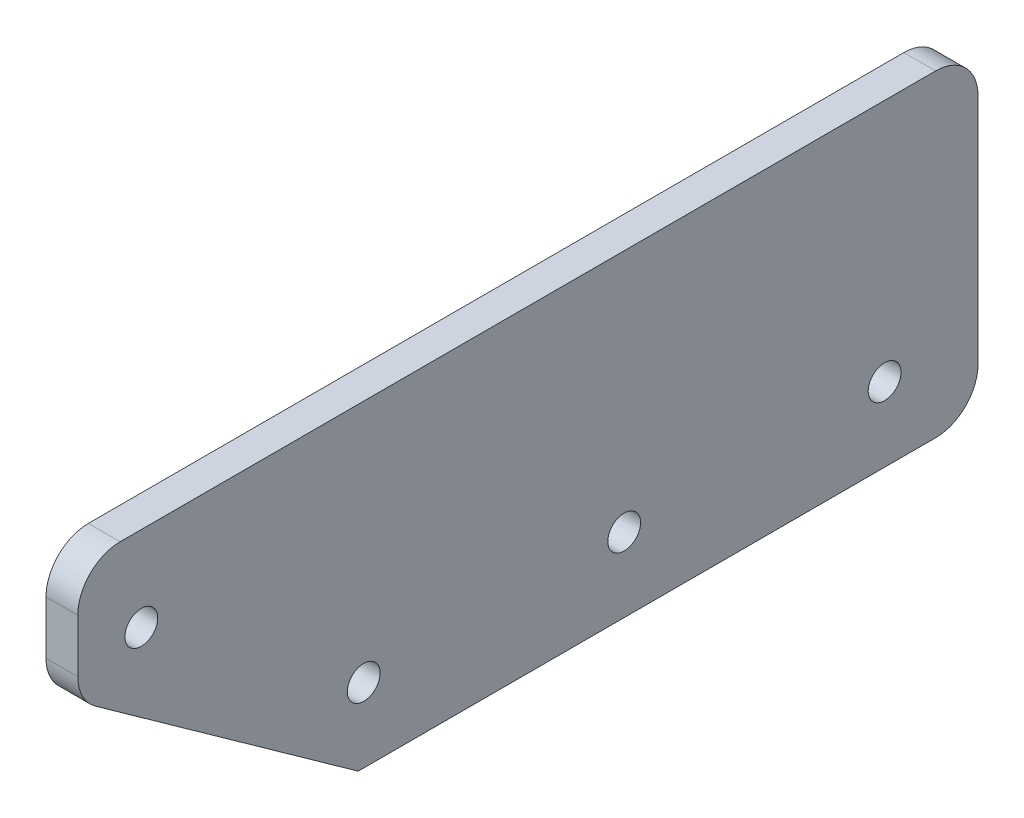
ISO-10303-21;
HEADER;
FILE_DESCRIPTION(('STEP AP214'),'2;1');
FILE_NAME('part.step','',(''),(''),'','','');
FILE_SCHEMA(('AUTOMOTIVE_DESIGN { 1 0 10303 214 1 1 1 1 }'));
ENDSEC;
DATA;
#1=APPLICATION_CONTEXT('core data for automotive mechanical design processes');
#2=APPLICATION_PROTOCOL_DEFINITION('international standard','automotive_design',2000,#1);
#3=PRODUCT_CONTEXT('',#1,'mechanical');
#4=PRODUCT('Part','Part','',(#3));
#5=PRODUCT_RELATED_PRODUCT_CATEGORY('part','',(#4));
#6=PRODUCT_DEFINITION_FORMATION('','',#4);
#7=PRODUCT_DEFINITION_CONTEXT('part definition',#1,'design');
#8=PRODUCT_DEFINITION('design','',#6,#7);
#9=PRODUCT_DEFINITION_SHAPE('','',#8);
#10=(LENGTH_UNIT() NAMED_UNIT(*) SI_UNIT(.MILLI.,.METRE.));
#11=(NAMED_UNIT(*) PLANE_ANGLE_UNIT() SI_UNIT($,.RADIAN.));
#12=(NAMED_UNIT(*) SI_UNIT($,.STERADIAN.) SOLID_ANGLE_UNIT());
#13=UNCERTAINTY_MEASURE_WITH_UNIT(LENGTH_MEASURE(1.E-05),#10,'distance_accuracy_value','');
#14=(GEOMETRIC_REPRESENTATION_CONTEXT(3) GLOBAL_UNCERTAINTY_ASSIGNED_CONTEXT((#13)) GLOBAL_UNIT_ASSIGNED_CONTEXT((#10,
#11,#12)) REPRESENTATION_CONTEXT('',''));
#15=CARTESIAN_POINT('',(0.,0.,0.));
#16=DIRECTION('',(0.,0.,1.));
#17=DIRECTION('',(1.,0.,0.));
#18=AXIS2_PLACEMENT_3D('',#15,#16,#17);
#19=CARTESIAN_POINT('',(3.,0.,0.));
#20=DIRECTION('',(0.,0.,-1.));
#21=DIRECTION('',(-1.,0.,0.));
#22=AXIS2_PLACEMENT_3D('',#19,#20,#21);
#23=PLANE('',#22);
#24=DIRECTION('',(0.,-1.,0.));
#25=VECTOR('',#24,1.);
#26=CARTESIAN_POINT('',(0.,0.,0.));
#27=LINE('',#26,#25);
#28=CARTESIAN_POINT('',(0.,26.,0.));
#29=VERTEX_POINT('',#28);
#30=CARTESIAN_POINT('',(0.,20.9707642094164,0.));
#31=VERTEX_POINT('',#30);
#32=EDGE_CURVE('E127',#29,#31,#27,.T.);
#33=ORIENTED_EDGE('',*,*,#32,.T.);
#34=DIRECTION('',(1.,0.,0.));
#35=VECTOR('',#34,1.);
#36=CARTESIAN_POINT('',(3.,20.9707642094164,0.));
#37=LINE('',#36,#35);
#38=CARTESIAN_POINT('',(3.,20.9707642094164,0.));
#39=VERTEX_POINT('',#38);
#40=EDGE_CURVE('E142',#31,#39,#37,.T.);
#41=ORIENTED_EDGE('',*,*,#40,.T.);
#42=DIRECTION('',(0.,-1.,0.));
#43=VECTOR('',#42,1.);
#44=CARTESIAN_POINT('',(3.,0.,0.));
#45=LINE('',#44,#43);
#46=CARTESIAN_POINT('',(3.,26.,0.));
#47=VERTEX_POINT('',#46);
#48=EDGE_CURVE('E138',#47,#39,#45,.T.);
#49=ORIENTED_EDGE('',*,*,#48,.F.);
#50=DIRECTION('',(-1.,0.,0.));
#51=VECTOR('',#50,1.);
#52=CARTESIAN_POINT('',(3.,26.,0.));
#53=LINE('',#52,#51);
#54=EDGE_CURVE('E139',#47,#29,#53,.T.);
#55=ORIENTED_EDGE('',*,*,#54,.T.);
#56=EDGE_LOOP('',(#33,#41,#49,#55));
#57=FACE_BOUND('',#56,.T.);
#58=ADVANCED_FACE('F35',(#57),#23,.F.);
#59=CARTESIAN_POINT('',(3.,0.,0.));
#60=DIRECTION('',(0.,1.,0.));
#61=DIRECTION('',(0.,0.,1.));
#62=AXIS2_PLACEMENT_3D('',#59,#60,#61);
#63=PLANE('',#62);
#64=DIRECTION('',(0.,0.,-1.));
#65=VECTOR('',#64,1.);
#66=CARTESIAN_POINT('',(0.,0.,0.));
#67=LINE('',#66,#65);
#68=CARTESIAN_POINT('',(0.,0.,-26.4772096795489));
#69=VERTEX_POINT('',#68);
#70=CARTESIAN_POINT('',(0.,0.,-81.));
#71=VERTEX_POINT('',#70);
#72=EDGE_CURVE('E118',#69,#71,#67,.T.);
#73=ORIENTED_EDGE('',*,*,#72,.T.);
#74=DIRECTION('',(-1.,0.,0.));
#75=VECTOR('',#74,1.);
#76=CARTESIAN_POINT('',(3.,0.,-81.));
#77=LINE('',#76,#75);
#78=CARTESIAN_POINT('',(3.,0.,-81.));
#79=VERTEX_POINT('',#78);
#80=EDGE_CURVE('E166',#71,#79,#77,.F.);
#81=ORIENTED_EDGE('',*,*,#80,.T.);
#82=DIRECTION('',(0.,0.,-1.));
#83=VECTOR('',#82,1.);
#84=CARTESIAN_POINT('',(3.,0.,0.));
#85=LINE('',#84,#83);
#86=CARTESIAN_POINT('',(3.,0.,-26.4772096795489));
#87=VERTEX_POINT('',#86);
#88=EDGE_CURVE('E121',#87,#79,#85,.T.);
#89=ORIENTED_EDGE('',*,*,#88,.F.);
#90=DIRECTION('',(1.,0.,0.));
#91=VECTOR('',#90,1.);
#92=CARTESIAN_POINT('',(0.,0.,-26.4772096795489));
#93=LINE('',#92,#91);
#94=EDGE_CURVE('E108',#69,#87,#93,.T.);
#95=ORIENTED_EDGE('',*,*,#94,.F.);
#96=EDGE_LOOP('',(#73,#81,#89,#95));
#97=FACE_BOUND('',#96,.T.);
#98=ADVANCED_FACE('F117',(#97),#63,.F.);
#99=CARTESIAN_POINT('',(3.,0.,-85.));
#100=DIRECTION('',(0.,0.,1.));
#101=DIRECTION('',(1.,0.,0.));
#102=AXIS2_PLACEMENT_3D('',#99,#100,#101);
#103=PLANE('',#102);
#104=DIRECTION('',(0.,1.,0.));
#105=VECTOR('',#104,1.);
#106=CARTESIAN_POINT('',(3.,0.,-85.));
#107=LINE('',#106,#105);
#108=CARTESIAN_POINT('',(3.,4.,-85.));
#109=VERTEX_POINT('',#108);
#110=CARTESIAN_POINT('',(3.,26.,-85.));
#111=VERTEX_POINT('',#110);
#112=EDGE_CURVE('E187',#109,#111,#107,.T.);
#113=ORIENTED_EDGE('',*,*,#112,.F.);
#114=DIRECTION('',(-1.,0.,0.));
#115=VECTOR('',#114,1.);
#116=CARTESIAN_POINT('',(3.,4.,-85.));
#117=LINE('',#116,#115);
#118=CARTESIAN_POINT('',(0.,4.,-85.));
#119=VERTEX_POINT('',#118);
#120=EDGE_CURVE('E163',#109,#119,#117,.T.);
#121=ORIENTED_EDGE('',*,*,#120,.T.);
#122=DIRECTION('',(0.,1.,0.));
#123=VECTOR('',#122,1.);
#124=CARTESIAN_POINT('',(0.,0.,-85.));
#125=LINE('',#124,#123);
#126=CARTESIAN_POINT('',(0.,26.,-85.));
#127=VERTEX_POINT('',#126);
#128=EDGE_CURVE('E126',#119,#127,#125,.T.);
#129=ORIENTED_EDGE('',*,*,#128,.T.);
#130=DIRECTION('',(-1.,0.,0.));
#131=VECTOR('',#130,1.);
#132=CARTESIAN_POINT('',(3.,26.,-85.));
#133=LINE('',#132,#131);
#134=EDGE_CURVE('E161',#127,#111,#133,.F.);
#135=ORIENTED_EDGE('',*,*,#134,.T.);
#136=EDGE_LOOP('',(#113,#121,#129,#135));
#137=FACE_BOUND('',#136,.T.);
#138=ADVANCED_FACE('F197',(#137),#103,.F.);
#139=CARTESIAN_POINT('',(3.,30.,0.));
#140=DIRECTION('',(0.,-1.,0.));
#141=DIRECTION('',(0.,0.,-1.));
#142=AXIS2_PLACEMENT_3D('',#139,#140,#141);
#143=PLANE('',#142);
#144=DIRECTION('',(0.,0.,1.));
#145=VECTOR('',#144,1.);
#146=CARTESIAN_POINT('',(0.,30.,0.));
#147=LINE('',#146,#145);
#148=CARTESIAN_POINT('',(0.,30.,-81.));
#149=VERTEX_POINT('',#148);
#150=CARTESIAN_POINT('',(0.,30.,-4.));
#151=VERTEX_POINT('',#150);
#152=EDGE_CURVE('E129',#149,#151,#147,.T.);
#153=ORIENTED_EDGE('',*,*,#152,.T.);
#154=DIRECTION('',(-1.,0.,0.));
#155=VECTOR('',#154,1.);
#156=CARTESIAN_POINT('',(3.,30.,-4.));
#157=LINE('',#156,#155);
#158=CARTESIAN_POINT('',(3.,30.,-4.));
#159=VERTEX_POINT('',#158);
#160=EDGE_CURVE('E11',#151,#159,#157,.F.);
#161=ORIENTED_EDGE('',*,*,#160,.T.);
#162=DIRECTION('',(0.,0.,1.));
#163=VECTOR('',#162,1.);
#164=CARTESIAN_POINT('',(3.,30.,0.));
#165=LINE('',#164,#163);
#166=CARTESIAN_POINT('',(3.,30.,-81.));
#167=VERTEX_POINT('',#166);
#168=EDGE_CURVE('E143',#167,#159,#165,.T.);
#169=ORIENTED_EDGE('',*,*,#168,.F.);
#170=DIRECTION('',(-1.,0.,0.));
#171=VECTOR('',#170,1.);
#172=CARTESIAN_POINT('',(3.,30.,-81.));
#173=LINE('',#172,#171);
#174=EDGE_CURVE('E43',#167,#149,#173,.T.);
#175=ORIENTED_EDGE('',*,*,#174,.T.);
#176=EDGE_LOOP('',(#153,#161,#169,#175));
#177=FACE_BOUND('',#176,.T.);
#178=ADVANCED_FACE('F171',(#177),#143,.F.);
#179=CARTESIAN_POINT('',(3.,0.,0.));
#180=DIRECTION('',(-1.,0.,0.));
#181=DIRECTION('',(0.,0.,1.));
#182=AXIS2_PLACEMENT_3D('',#179,#180,#181);
#183=PLANE('',#182);
#184=CARTESIAN_POINT('',(3.,22.,-6.));
#185=DIRECTION('',(1.,0.,0.));
#186=DIRECTION('',(0.,0.,-1.));
#187=AXIS2_PLACEMENT_3D('',#184,#185,#186);
#188=CIRCLE('',#187,1.55);
#189=CARTESIAN_POINT('',(3.,22.,-7.55));
#190=VERTEX_POINT('',#189);
#191=EDGE_CURVE('E206',#190,#190,#188,.T.);
#192=ORIENTED_EDGE('',*,*,#191,.F.);
#193=EDGE_LOOP('',(#192));
#194=FACE_BOUND('',#193,.T.);
#195=CARTESIAN_POINT('',(3.,7.,-27.));
#196=DIRECTION('',(1.,0.,0.));
#197=DIRECTION('',(0.,0.,-1.));
#198=AXIS2_PLACEMENT_3D('',#195,#196,#197);
#199=CIRCLE('',#198,1.55);
#200=CARTESIAN_POINT('',(3.,7.,-28.55));
#201=VERTEX_POINT('',#200);
#202=EDGE_CURVE('E212',#201,#201,#199,.T.);
#203=ORIENTED_EDGE('',*,*,#202,.F.);
#204=EDGE_LOOP('',(#203));
#205=FACE_BOUND('',#204,.T.);
#206=CARTESIAN_POINT('',(3.,7.,-51.5918746695755));
#207=DIRECTION('',(1.,0.,0.));
#208=DIRECTION('',(0.,0.,-1.));
#209=AXIS2_PLACEMENT_3D('',#206,#207,#208);
#210=CIRCLE('',#209,1.55);
#211=CARTESIAN_POINT('',(3.,7.,-53.1418746695755));
#212=VERTEX_POINT('',#211);
#213=EDGE_CURVE('E218',#212,#212,#210,.T.);
#214=ORIENTED_EDGE('',*,*,#213,.F.);
#215=EDGE_LOOP('',(#214));
#216=FACE_BOUND('',#215,.T.);
#217=CARTESIAN_POINT('',(3.,7.00000000000001,-76.1837493391511));
#218=DIRECTION('',(1.,0.,0.));
#219=DIRECTION('',(0.,0.,-1.));
#220=AXIS2_PLACEMENT_3D('',#217,#218,#219);
#221=CIRCLE('',#220,1.54999999999999);
#222=CARTESIAN_POINT('',(3.,7.00000000000001,-77.7337493391511));
#223=VERTEX_POINT('',#222);
#224=EDGE_CURVE('E122',#223,#223,#221,.T.);
#225=ORIENTED_EDGE('',*,*,#224,.F.);
#226=EDGE_LOOP('',(#225));
#227=FACE_BOUND('',#226,.T.);
#228=ORIENTED_EDGE('',*,*,#48,.T.);
#229=CARTESIAN_POINT('',(3.,20.9707642094164,-4.));
#230=DIRECTION('',(-1.,0.,0.));
#231=DIRECTION('',(0.,0.,1.));
#232=AXIS2_PLACEMENT_3D('',#229,#230,#231);
#233=CIRCLE('',#232,4.);
#234=CARTESIAN_POINT('',(3.,17.7158303245895,-1.67504722512361));
#235=VERTEX_POINT('',#234);
#236=EDGE_CURVE('E152',#39,#235,#233,.F.);
#237=ORIENTED_EDGE('',*,*,#236,.T.);
#238=DIRECTION('',(0.,0.581238193719096,0.813733471206735));
#239=VECTOR('',#238,1.);
#240=CARTESIAN_POINT('',(3.,18.9122926282492,0.));
#241=LINE('',#240,#239);
#242=EDGE_CURVE('E113',#87,#235,#241,.T.);
#243=ORIENTED_EDGE('',*,*,#242,.F.);
#244=ORIENTED_EDGE('',*,*,#88,.T.);
#245=CARTESIAN_POINT('',(3.,4.,-81.));
#246=DIRECTION('',(-1.,0.,0.));
#247=DIRECTION('',(0.,0.,1.));
#248=AXIS2_PLACEMENT_3D('',#245,#246,#247);
#249=CIRCLE('',#248,4.);
#250=EDGE_CURVE('E150',#79,#109,#249,.F.);
#251=ORIENTED_EDGE('',*,*,#250,.T.);
#252=ORIENTED_EDGE('',*,*,#112,.T.);
#253=CARTESIAN_POINT('',(3.,26.,-81.));
#254=DIRECTION('',(-1.,0.,0.));
#255=DIRECTION('',(0.,0.,1.));
#256=AXIS2_PLACEMENT_3D('',#253,#254,#255);
#257=CIRCLE('',#256,4.);
#258=EDGE_CURVE('E146',#111,#167,#257,.F.);
#259=ORIENTED_EDGE('',*,*,#258,.T.);
#260=ORIENTED_EDGE('',*,*,#168,.T.);
#261=CARTESIAN_POINT('',(3.,26.,-4.));
#262=DIRECTION('',(-1.,0.,0.));
#263=DIRECTION('',(0.,0.,1.));
#264=AXIS2_PLACEMENT_3D('',#261,#262,#263);
#265=CIRCLE('',#264,4.);
#266=EDGE_CURVE('E148',#159,#47,#265,.F.);
#267=ORIENTED_EDGE('',*,*,#266,.T.);
#268=EDGE_LOOP('',(#228,#237,#243,#244,#251,#252,#259,#260,#267));
#269=FACE_BOUND('',#268,.T.);
#270=ADVANCED_FACE('F193',(#194,#205,#216,#227,#269),#183,.F.);
#271=CARTESIAN_POINT('',(0.,0.,0.));
#272=DIRECTION('',(-1.,0.,0.));
#273=DIRECTION('',(0.,0.,1.));
#274=AXIS2_PLACEMENT_3D('',#271,#272,#273);
#275=PLANE('',#274);
#276=DIRECTION('',(0.,0.581238193719096,0.813733471206735));
#277=VECTOR('',#276,1.);
#278=CARTESIAN_POINT('',(0.,18.9122926282492,0.));
#279=LINE('',#278,#277);
#280=CARTESIAN_POINT('',(0.,17.7158303245895,-1.67504722512361));
#281=VERTEX_POINT('',#280);
#282=EDGE_CURVE('E104',#69,#281,#279,.T.);
#283=ORIENTED_EDGE('',*,*,#282,.T.);
#284=CARTESIAN_POINT('',(0.,20.9707642094164,-4.));
#285=DIRECTION('',(-1.,0.,0.));
#286=DIRECTION('',(0.,0.,1.));
#287=AXIS2_PLACEMENT_3D('',#284,#285,#286);
#288=CIRCLE('',#287,4.);
#289=EDGE_CURVE('E159',#281,#31,#288,.T.);
#290=ORIENTED_EDGE('',*,*,#289,.T.);
#291=ORIENTED_EDGE('',*,*,#32,.F.);
#292=CARTESIAN_POINT('',(0.,26.,-4.));
#293=DIRECTION('',(-1.,0.,0.));
#294=DIRECTION('',(0.,0.,1.));
#295=AXIS2_PLACEMENT_3D('',#292,#293,#294);
#296=CIRCLE('',#295,4.);
#297=EDGE_CURVE('E156',#29,#151,#296,.T.);
#298=ORIENTED_EDGE('',*,*,#297,.T.);
#299=ORIENTED_EDGE('',*,*,#152,.F.);
#300=CARTESIAN_POINT('',(0.,26.,-81.));
#301=DIRECTION('',(-1.,0.,0.));
#302=DIRECTION('',(0.,0.,1.));
#303=AXIS2_PLACEMENT_3D('',#300,#301,#302);
#304=CIRCLE('',#303,4.);
#305=EDGE_CURVE('E56',#149,#127,#304,.T.);
#306=ORIENTED_EDGE('',*,*,#305,.T.);
#307=ORIENTED_EDGE('',*,*,#128,.F.);
#308=CARTESIAN_POINT('',(0.,4.,-81.));
#309=DIRECTION('',(-1.,0.,0.));
#310=DIRECTION('',(0.,0.,1.));
#311=AXIS2_PLACEMENT_3D('',#308,#309,#310);
#312=CIRCLE('',#311,4.);
#313=EDGE_CURVE('E50',#119,#71,#312,.T.);
#314=ORIENTED_EDGE('',*,*,#313,.T.);
#315=ORIENTED_EDGE('',*,*,#72,.F.);
#316=EDGE_LOOP('',(#283,#290,#291,#298,#299,#306,#307,#314,#315));
#317=FACE_BOUND('',#316,.T.);
#318=CARTESIAN_POINT('',(0.,22.,-6.));
#319=DIRECTION('',(1.,0.,0.));
#320=DIRECTION('',(0.,0.,-1.));
#321=AXIS2_PLACEMENT_3D('',#318,#319,#320);
#322=CIRCLE('',#321,1.55);
#323=CARTESIAN_POINT('',(0.,22.,-7.55));
#324=VERTEX_POINT('',#323);
#325=EDGE_CURVE('E132',#324,#324,#322,.T.);
#326=ORIENTED_EDGE('',*,*,#325,.T.);
#327=EDGE_LOOP('',(#326));
#328=FACE_BOUND('',#327,.T.);
#329=CARTESIAN_POINT('',(0.,7.,-27.));
#330=DIRECTION('',(1.,0.,0.));
#331=DIRECTION('',(0.,0.,-1.));
#332=AXIS2_PLACEMENT_3D('',#329,#330,#331);
#333=CIRCLE('',#332,1.55);
#334=CARTESIAN_POINT('',(0.,7.,-28.55));
#335=VERTEX_POINT('',#334);
#336=EDGE_CURVE('E209',#335,#335,#333,.T.);
#337=ORIENTED_EDGE('',*,*,#336,.T.);
#338=EDGE_LOOP('',(#337));
#339=FACE_BOUND('',#338,.T.);
#340=CARTESIAN_POINT('',(0.,7.,-51.5918746695755));
#341=DIRECTION('',(1.,0.,0.));
#342=DIRECTION('',(0.,0.,-1.));
#343=AXIS2_PLACEMENT_3D('',#340,#341,#342);
#344=CIRCLE('',#343,1.55);
#345=CARTESIAN_POINT('',(0.,7.,-53.1418746695755));
#346=VERTEX_POINT('',#345);
#347=EDGE_CURVE('E215',#346,#346,#344,.T.);
#348=ORIENTED_EDGE('',*,*,#347,.T.);
#349=EDGE_LOOP('',(#348));
#350=FACE_BOUND('',#349,.T.);
#351=CARTESIAN_POINT('',(0.,7.00000000000001,-76.1837493391511));
#352=DIRECTION('',(1.,0.,0.));
#353=DIRECTION('',(0.,0.,-1.));
#354=AXIS2_PLACEMENT_3D('',#351,#352,#353);
#355=CIRCLE('',#354,1.54999999999999);
#356=CARTESIAN_POINT('',(0.,7.00000000000001,-77.7337493391511));
#357=VERTEX_POINT('',#356);
#358=EDGE_CURVE('E220',#357,#357,#355,.T.);
#359=ORIENTED_EDGE('',*,*,#358,.T.);
#360=EDGE_LOOP('',(#359));
#361=FACE_BOUND('',#360,.T.);
#362=ADVANCED_FACE('F124',(#317,#328,#339,#350,#361),#275,.T.);
#363=CARTESIAN_POINT('',(0.,7.00000000000001,-76.1837493391511));
#364=DIRECTION('',(1.,0.,0.));
#365=DIRECTION('',(0.,0.,-1.));
#366=AXIS2_PLACEMENT_3D('',#363,#364,#365);
#367=CYLINDRICAL_SURFACE('',#366,1.54999999999999);
#368=ORIENTED_EDGE('',*,*,#358,.F.);
#369=EDGE_LOOP('',(#368));
#370=FACE_BOUND('',#369,.T.);
#371=ORIENTED_EDGE('',*,*,#224,.T.);
#372=EDGE_LOOP('',(#371));
#373=FACE_BOUND('',#372,.T.);
#374=ADVANCED_FACE('F227',(#370,#373),#367,.F.);
#375=CARTESIAN_POINT('',(0.,7.,-51.5918746695755));
#376=DIRECTION('',(1.,0.,0.));
#377=DIRECTION('',(0.,0.,-1.));
#378=AXIS2_PLACEMENT_3D('',#375,#376,#377);
#379=CYLINDRICAL_SURFACE('',#378,1.55);
#380=ORIENTED_EDGE('',*,*,#347,.F.);
#381=EDGE_LOOP('',(#380));
#382=FACE_BOUND('',#381,.T.);
#383=ORIENTED_EDGE('',*,*,#213,.T.);
#384=EDGE_LOOP('',(#383));
#385=FACE_BOUND('',#384,.T.);
#386=ADVANCED_FACE('F303',(#382,#385),#379,.F.);
#387=CARTESIAN_POINT('',(0.,7.,-27.));
#388=DIRECTION('',(1.,0.,0.));
#389=DIRECTION('',(0.,0.,-1.));
#390=AXIS2_PLACEMENT_3D('',#387,#388,#389);
#391=CYLINDRICAL_SURFACE('',#390,1.55);
#392=ORIENTED_EDGE('',*,*,#336,.F.);
#393=EDGE_LOOP('',(#392));
#394=FACE_BOUND('',#393,.T.);
#395=ORIENTED_EDGE('',*,*,#202,.T.);
#396=EDGE_LOOP('',(#395));
#397=FACE_BOUND('',#396,.T.);
#398=ADVANCED_FACE('F309',(#394,#397),#391,.F.);
#399=CARTESIAN_POINT('',(0.,22.,-6.));
#400=DIRECTION('',(1.,0.,0.));
#401=DIRECTION('',(0.,0.,-1.));
#402=AXIS2_PLACEMENT_3D('',#399,#400,#401);
#403=CYLINDRICAL_SURFACE('',#402,1.55);
#404=ORIENTED_EDGE('',*,*,#325,.F.);
#405=EDGE_LOOP('',(#404));
#406=FACE_BOUND('',#405,.T.);
#407=ORIENTED_EDGE('',*,*,#191,.T.);
#408=EDGE_LOOP('',(#407));
#409=FACE_BOUND('',#408,.T.);
#410=ADVANCED_FACE('F285',(#406,#409),#403,.F.);
#411=CARTESIAN_POINT('',(0.,18.9122926282492,0.));
#412=DIRECTION('',(0.,0.813733471206735,-0.581238193719096));
#413=DIRECTION('',(0.,0.581238193719096,0.813733471206735));
#414=AXIS2_PLACEMENT_3D('',#411,#412,#413);
#415=PLANE('',#414);
#416=ORIENTED_EDGE('',*,*,#242,.T.);
#417=DIRECTION('',(1.,0.,0.));
#418=VECTOR('',#417,1.);
#419=CARTESIAN_POINT('',(0.,17.7158303245895,-1.67504722512361));
#420=LINE('',#419,#418);
#421=EDGE_CURVE('E111',#235,#281,#420,.F.);
#422=ORIENTED_EDGE('',*,*,#421,.T.);
#423=ORIENTED_EDGE('',*,*,#282,.F.);
#424=ORIENTED_EDGE('',*,*,#94,.T.);
#425=EDGE_LOOP('',(#416,#422,#423,#424));
#426=FACE_BOUND('',#425,.T.);
#427=ADVANCED_FACE('F107',(#426),#415,.F.);
#428=CARTESIAN_POINT('',(3.,20.9707642094164,-4.));
#429=DIRECTION('',(1.,0.,0.));
#430=DIRECTION('',(0.,0.,-1.));
#431=AXIS2_PLACEMENT_3D('',#428,#429,#430);
#432=CYLINDRICAL_SURFACE('',#431,4.);
#433=ORIENTED_EDGE('',*,*,#289,.F.);
#434=ORIENTED_EDGE('',*,*,#421,.F.);
#435=ORIENTED_EDGE('',*,*,#236,.F.);
#436=ORIENTED_EDGE('',*,*,#40,.F.);
#437=EDGE_LOOP('',(#433,#434,#435,#436));
#438=FACE_BOUND('',#437,.T.);
#439=ADVANCED_FACE('F250',(#438),#432,.T.);
#440=CARTESIAN_POINT('',(3.,4.,-81.));
#441=DIRECTION('',(-1.,0.,0.));
#442=DIRECTION('',(0.,0.,1.));
#443=AXIS2_PLACEMENT_3D('',#440,#441,#442);
#444=CYLINDRICAL_SURFACE('',#443,4.);
#445=ORIENTED_EDGE('',*,*,#250,.F.);
#446=ORIENTED_EDGE('',*,*,#80,.F.);
#447=ORIENTED_EDGE('',*,*,#313,.F.);
#448=ORIENTED_EDGE('',*,*,#120,.F.);
#449=EDGE_LOOP('',(#445,#446,#447,#448));
#450=FACE_BOUND('',#449,.T.);
#451=ADVANCED_FACE('F201',(#450),#444,.T.);
#452=CARTESIAN_POINT('',(3.,26.,-4.));
#453=DIRECTION('',(-1.,0.,0.));
#454=DIRECTION('',(0.,0.,1.));
#455=AXIS2_PLACEMENT_3D('',#452,#453,#454);
#456=CYLINDRICAL_SURFACE('',#455,4.);
#457=ORIENTED_EDGE('',*,*,#266,.F.);
#458=ORIENTED_EDGE('',*,*,#160,.F.);
#459=ORIENTED_EDGE('',*,*,#297,.F.);
#460=ORIENTED_EDGE('',*,*,#54,.F.);
#461=EDGE_LOOP('',(#457,#458,#459,#460));
#462=FACE_BOUND('',#461,.T.);
#463=ADVANCED_FACE('F180',(#462),#456,.T.);
#464=CARTESIAN_POINT('',(3.,26.,-81.));
#465=DIRECTION('',(-1.,0.,0.));
#466=DIRECTION('',(0.,0.,1.));
#467=AXIS2_PLACEMENT_3D('',#464,#465,#466);
#468=CYLINDRICAL_SURFACE('',#467,4.);
#469=ORIENTED_EDGE('',*,*,#258,.F.);
#470=ORIENTED_EDGE('',*,*,#134,.F.);
#471=ORIENTED_EDGE('',*,*,#305,.F.);
#472=ORIENTED_EDGE('',*,*,#174,.F.);
#473=EDGE_LOOP('',(#469,#470,#471,#472));
#474=FACE_BOUND('',#473,.T.);
#475=ADVANCED_FACE('F37',(#474),#468,.T.);
#476=CLOSED_SHELL('',(#58,#98,#138,#178,#270,#362,#374,#386,#398,#410,#427,#439,#451,#463,#475));
#477=MANIFOLD_SOLID_BREP('B2',#476);
#478=ADVANCED_BREP_SHAPE_REPRESENTATION('',(#18,#477),#14);
#479=SHAPE_DEFINITION_REPRESENTATION(#9,#478);
ENDSEC;
END-ISO-10303-21;
